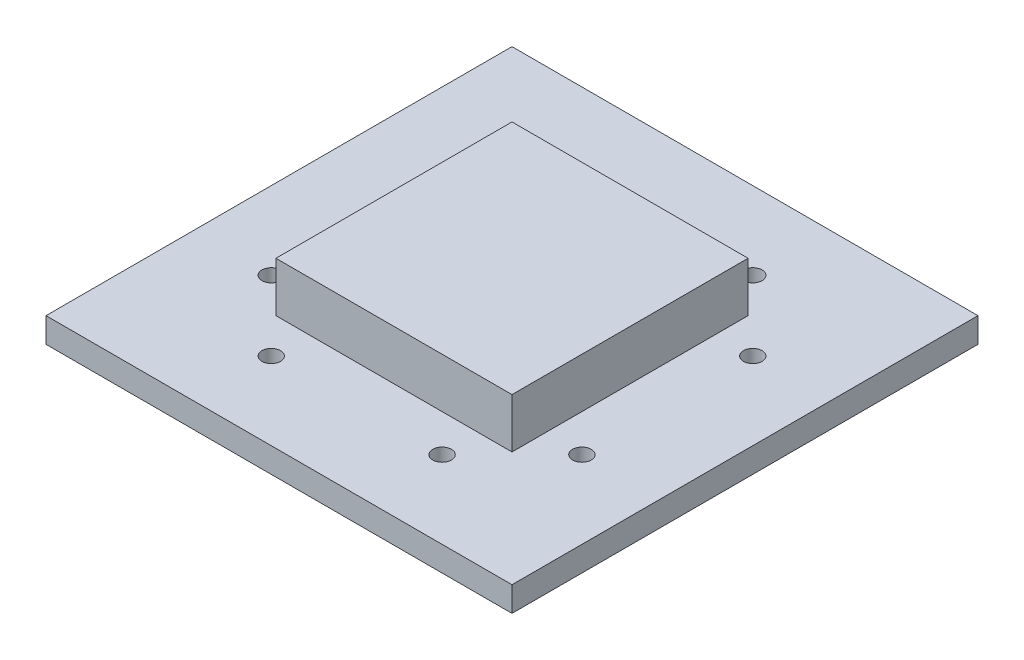
ISO-10303-21;
HEADER;
FILE_DESCRIPTION(('STEP AP214'),'2;1');
FILE_NAME('part.step','',(''),(''),'','','');
FILE_SCHEMA(('AUTOMOTIVE_DESIGN { 1 0 10303 214 1 1 1 1 }'));
ENDSEC;
DATA;
#1=APPLICATION_CONTEXT('core data for automotive mechanical design processes');
#2=APPLICATION_PROTOCOL_DEFINITION('international standard','automotive_design',2000,#1);
#3=PRODUCT_CONTEXT('',#1,'mechanical');
#4=PRODUCT('Part','Part','',(#3));
#5=PRODUCT_RELATED_PRODUCT_CATEGORY('part','',(#4));
#6=PRODUCT_DEFINITION_FORMATION('','',#4);
#7=PRODUCT_DEFINITION_CONTEXT('part definition',#1,'design');
#8=PRODUCT_DEFINITION('design','',#6,#7);
#9=PRODUCT_DEFINITION_SHAPE('','',#8);
#10=(LENGTH_UNIT() NAMED_UNIT(*) SI_UNIT(.MILLI.,.METRE.));
#11=(NAMED_UNIT(*) PLANE_ANGLE_UNIT() SI_UNIT($,.RADIAN.));
#12=(NAMED_UNIT(*) SI_UNIT($,.STERADIAN.) SOLID_ANGLE_UNIT());
#13=UNCERTAINTY_MEASURE_WITH_UNIT(LENGTH_MEASURE(1.E-05),#10,'distance_accuracy_value','');
#14=(GEOMETRIC_REPRESENTATION_CONTEXT(3) GLOBAL_UNCERTAINTY_ASSIGNED_CONTEXT((#13)) GLOBAL_UNIT_ASSIGNED_CONTEXT((#10,
#11,#12)) REPRESENTATION_CONTEXT('',''));
#15=CARTESIAN_POINT('',(0.,0.,0.));
#16=DIRECTION('',(0.,0.,1.));
#17=DIRECTION('',(1.,0.,0.));
#18=AXIS2_PLACEMENT_3D('',#15,#16,#17);
#19=CARTESIAN_POINT('',(0.,1.6,0.));
#20=DIRECTION('',(0.,1.,0.));
#21=DIRECTION('',(0.,0.,1.));
#22=AXIS2_PLACEMENT_3D('',#19,#20,#21);
#23=PLANE('',#22);
#24=CARTESIAN_POINT('',(25.,1.6,-9.50000000000003));
#25=DIRECTION('',(0.,1.,0.));
#26=DIRECTION('',(-1.,0.,0.));
#27=AXIS2_PLACEMENT_3D('',#24,#25,#26);
#28=CIRCLE('',#27,0.6);
#29=CARTESIAN_POINT('',(24.4,1.6,-9.50000000000003));
#30=VERTEX_POINT('',#29);
#31=EDGE_CURVE('E151',#30,#30,#28,.T.);
#32=ORIENTED_EDGE('',*,*,#31,.F.);
#33=EDGE_LOOP('',(#32));
#34=FACE_BOUND('',#33,.T.);
#35=CARTESIAN_POINT('',(4.99999999999998,1.6,-20.5));
#36=DIRECTION('',(0.,1.,0.));
#37=DIRECTION('',(-1.,0.,0.));
#38=AXIS2_PLACEMENT_3D('',#35,#36,#37);
#39=CIRCLE('',#38,0.6);
#40=CARTESIAN_POINT('',(4.39999999999998,1.6,-20.5));
#41=VERTEX_POINT('',#40);
#42=EDGE_CURVE('E145',#41,#41,#39,.T.);
#43=ORIENTED_EDGE('',*,*,#42,.F.);
#44=EDGE_LOOP('',(#43));
#45=FACE_BOUND('',#44,.T.);
#46=CARTESIAN_POINT('',(5.00000000000002,1.6,-9.49999999999996));
#47=DIRECTION('',(0.,1.,0.));
#48=DIRECTION('',(1.,0.,0.));
#49=AXIS2_PLACEMENT_3D('',#46,#47,#48);
#50=CIRCLE('',#49,0.6);
#51=CARTESIAN_POINT('',(5.60000000000001,1.6,-9.49999999999996));
#52=VERTEX_POINT('',#51);
#53=EDGE_CURVE('E136',#52,#52,#50,.T.);
#54=ORIENTED_EDGE('',*,*,#53,.F.);
#55=EDGE_LOOP('',(#54));
#56=FACE_BOUND('',#55,.T.);
#57=CARTESIAN_POINT('',(25.,1.6,-20.5));
#58=DIRECTION('',(0.,1.,0.));
#59=DIRECTION('',(1.,0.,0.));
#60=AXIS2_PLACEMENT_3D('',#57,#58,#59);
#61=CIRCLE('',#60,0.6);
#62=CARTESIAN_POINT('',(25.6,1.6,-20.5));
#63=VERTEX_POINT('',#62);
#64=EDGE_CURVE('E150',#63,#63,#61,.T.);
#65=ORIENTED_EDGE('',*,*,#64,.F.);
#66=EDGE_LOOP('',(#65));
#67=FACE_BOUND('',#66,.T.);
#68=CARTESIAN_POINT('',(9.5,1.6,-5.));
#69=DIRECTION('',(0.,1.,0.));
#70=DIRECTION('',(0.,0.,-1.));
#71=AXIS2_PLACEMENT_3D('',#68,#69,#70);
#72=CIRCLE('',#71,0.6);
#73=CARTESIAN_POINT('',(9.5,1.6,-5.6));
#74=VERTEX_POINT('',#73);
#75=EDGE_CURVE('E175',#74,#74,#72,.T.);
#76=ORIENTED_EDGE('',*,*,#75,.F.);
#77=EDGE_LOOP('',(#76));
#78=FACE_BOUND('',#77,.T.);
#79=CARTESIAN_POINT('',(20.5,1.6,-25.));
#80=DIRECTION('',(0.,1.,0.));
#81=DIRECTION('',(0.,0.,-1.));
#82=AXIS2_PLACEMENT_3D('',#79,#80,#81);
#83=CIRCLE('',#82,0.6);
#84=CARTESIAN_POINT('',(20.5,1.6,-25.6));
#85=VERTEX_POINT('',#84);
#86=EDGE_CURVE('E168',#85,#85,#83,.T.);
#87=ORIENTED_EDGE('',*,*,#86,.F.);
#88=EDGE_LOOP('',(#87));
#89=FACE_BOUND('',#88,.T.);
#90=CARTESIAN_POINT('',(9.5,1.6,-25.));
#91=DIRECTION('',(0.,1.,0.));
#92=DIRECTION('',(0.,0.,1.));
#93=AXIS2_PLACEMENT_3D('',#90,#91,#92);
#94=CIRCLE('',#93,0.6);
#95=CARTESIAN_POINT('',(9.5,1.6,-24.4));
#96=VERTEX_POINT('',#95);
#97=EDGE_CURVE('E162',#96,#96,#94,.T.);
#98=ORIENTED_EDGE('',*,*,#97,.F.);
#99=EDGE_LOOP('',(#98));
#100=FACE_BOUND('',#99,.T.);
#101=CARTESIAN_POINT('',(20.5,1.6,-5.));
#102=DIRECTION('',(0.,1.,0.));
#103=DIRECTION('',(0.,0.,1.));
#104=AXIS2_PLACEMENT_3D('',#101,#102,#103);
#105=CIRCLE('',#104,0.6);
#106=CARTESIAN_POINT('',(20.5,1.6,-4.4));
#107=VERTEX_POINT('',#106);
#108=EDGE_CURVE('E174',#107,#107,#105,.T.);
#109=ORIENTED_EDGE('',*,*,#108,.F.);
#110=EDGE_LOOP('',(#109));
#111=FACE_BOUND('',#110,.T.);
#112=DIRECTION('',(1.,0.,0.));
#113=VECTOR('',#112,1.);
#114=CARTESIAN_POINT('',(0.,1.6,0.));
#115=LINE('',#114,#113);
#116=CARTESIAN_POINT('',(0.,1.6,0.));
#117=VERTEX_POINT('',#116);
#118=CARTESIAN_POINT('',(30.,1.6,0.));
#119=VERTEX_POINT('',#118);
#120=EDGE_CURVE('E189',#117,#119,#115,.T.);
#121=ORIENTED_EDGE('',*,*,#120,.T.);
#122=DIRECTION('',(0.,0.,-1.));
#123=VECTOR('',#122,1.);
#124=CARTESIAN_POINT('',(30.,1.6,0.));
#125=LINE('',#124,#123);
#126=CARTESIAN_POINT('',(30.,1.6,-30.));
#127=VERTEX_POINT('',#126);
#128=EDGE_CURVE('E88',#119,#127,#125,.T.);
#129=ORIENTED_EDGE('',*,*,#128,.T.);
#130=DIRECTION('',(1.,0.,0.));
#131=VECTOR('',#130,1.);
#132=CARTESIAN_POINT('',(0.,1.6,-30.));
#133=LINE('',#132,#131);
#134=CARTESIAN_POINT('',(0.,1.6,-30.));
#135=VERTEX_POINT('',#134);
#136=EDGE_CURVE('E193',#135,#127,#133,.T.);
#137=ORIENTED_EDGE('',*,*,#136,.F.);
#138=DIRECTION('',(0.,0.,-1.));
#139=VECTOR('',#138,1.);
#140=CARTESIAN_POINT('',(0.,1.6,0.));
#141=LINE('',#140,#139);
#142=EDGE_CURVE('E196',#117,#135,#141,.T.);
#143=ORIENTED_EDGE('',*,*,#142,.F.);
#144=EDGE_LOOP('',(#121,#129,#137,#143));
#145=FACE_BOUND('',#144,.T.);
#146=DIRECTION('',(-1.,0.,0.));
#147=VECTOR('',#146,1.);
#148=CARTESIAN_POINT('',(7.4,1.6,-22.6));
#149=LINE('',#148,#147);
#150=CARTESIAN_POINT('',(22.6,1.6,-22.6));
#151=VERTEX_POINT('',#150);
#152=CARTESIAN_POINT('',(7.4,1.6,-22.6));
#153=VERTEX_POINT('',#152);
#154=EDGE_CURVE('E406',#151,#153,#149,.T.);
#155=ORIENTED_EDGE('',*,*,#154,.F.);
#156=DIRECTION('',(0.,0.,-1.));
#157=VECTOR('',#156,1.);
#158=CARTESIAN_POINT('',(22.6,1.6,-22.6));
#159=LINE('',#158,#157);
#160=CARTESIAN_POINT('',(22.6,1.6,-7.4));
#161=VERTEX_POINT('',#160);
#162=EDGE_CURVE('E134',#161,#151,#159,.T.);
#163=ORIENTED_EDGE('',*,*,#162,.F.);
#164=DIRECTION('',(1.,0.,0.));
#165=VECTOR('',#164,1.);
#166=CARTESIAN_POINT('',(7.4,1.6,-7.4));
#167=LINE('',#166,#165);
#168=CARTESIAN_POINT('',(7.4,1.6,-7.4));
#169=VERTEX_POINT('',#168);
#170=EDGE_CURVE('E130',#169,#161,#167,.T.);
#171=ORIENTED_EDGE('',*,*,#170,.F.);
#172=DIRECTION('',(0.,0.,1.));
#173=VECTOR('',#172,1.);
#174=CARTESIAN_POINT('',(7.4,1.6,-22.6));
#175=LINE('',#174,#173);
#176=EDGE_CURVE('E403',#153,#169,#175,.T.);
#177=ORIENTED_EDGE('',*,*,#176,.F.);
#178=EDGE_LOOP('',(#155,#163,#171,#177));
#179=FACE_BOUND('',#178,.T.);
#180=ADVANCED_FACE('F38',(#34,#45,#56,#67,#78,#89,#100,#111,#145,#179),#23,.T.);
#181=CARTESIAN_POINT('',(0.,1.6,0.));
#182=DIRECTION('',(0.,0.,-1.));
#183=DIRECTION('',(-1.,0.,0.));
#184=AXIS2_PLACEMENT_3D('',#181,#182,#183);
#185=PLANE('',#184);
#186=DIRECTION('',(1.,0.,0.));
#187=VECTOR('',#186,1.);
#188=CARTESIAN_POINT('',(0.,0.,0.));
#189=LINE('',#188,#187);
#190=CARTESIAN_POINT('',(0.,0.,0.));
#191=VERTEX_POINT('',#190);
#192=CARTESIAN_POINT('',(30.,0.,0.));
#193=VERTEX_POINT('',#192);
#194=EDGE_CURVE('E186',#191,#193,#189,.T.);
#195=ORIENTED_EDGE('',*,*,#194,.T.);
#196=DIRECTION('',(0.,-1.,0.));
#197=VECTOR('',#196,1.);
#198=CARTESIAN_POINT('',(30.,1.6,0.));
#199=LINE('',#198,#197);
#200=EDGE_CURVE('E11',#119,#193,#199,.T.);
#201=ORIENTED_EDGE('',*,*,#200,.F.);
#202=ORIENTED_EDGE('',*,*,#120,.F.);
#203=DIRECTION('',(0.,-1.,0.));
#204=VECTOR('',#203,1.);
#205=CARTESIAN_POINT('',(0.,1.6,0.));
#206=LINE('',#205,#204);
#207=EDGE_CURVE('E62',#117,#191,#206,.T.);
#208=ORIENTED_EDGE('',*,*,#207,.T.);
#209=EDGE_LOOP('',(#195,#201,#202,#208));
#210=FACE_BOUND('',#209,.T.);
#211=ADVANCED_FACE('F40',(#210),#185,.F.);
#212=CARTESIAN_POINT('',(30.,1.6,0.));
#213=DIRECTION('',(-1.,0.,0.));
#214=DIRECTION('',(0.,0.,1.));
#215=AXIS2_PLACEMENT_3D('',#212,#213,#214);
#216=PLANE('',#215);
#217=DIRECTION('',(0.,0.,-1.));
#218=VECTOR('',#217,1.);
#219=CARTESIAN_POINT('',(30.,0.,0.));
#220=LINE('',#219,#218);
#221=CARTESIAN_POINT('',(30.,0.,-30.));
#222=VERTEX_POINT('',#221);
#223=EDGE_CURVE('E199',#193,#222,#220,.T.);
#224=ORIENTED_EDGE('',*,*,#223,.T.);
#225=DIRECTION('',(0.,-1.,0.));
#226=VECTOR('',#225,1.);
#227=CARTESIAN_POINT('',(30.,1.6,-30.));
#228=LINE('',#227,#226);
#229=EDGE_CURVE('E46',#127,#222,#228,.T.);
#230=ORIENTED_EDGE('',*,*,#229,.F.);
#231=ORIENTED_EDGE('',*,*,#128,.F.);
#232=ORIENTED_EDGE('',*,*,#200,.T.);
#233=EDGE_LOOP('',(#224,#230,#231,#232));
#234=FACE_BOUND('',#233,.T.);
#235=ADVANCED_FACE('F213',(#234),#216,.F.);
#236=CARTESIAN_POINT('',(0.,1.6,-30.));
#237=DIRECTION('',(0.,0.,-1.));
#238=DIRECTION('',(-1.,0.,0.));
#239=AXIS2_PLACEMENT_3D('',#236,#237,#238);
#240=PLANE('',#239);
#241=DIRECTION('',(1.,0.,0.));
#242=VECTOR('',#241,1.);
#243=CARTESIAN_POINT('',(0.,0.,-30.));
#244=LINE('',#243,#242);
#245=CARTESIAN_POINT('',(0.,0.,-30.));
#246=VERTEX_POINT('',#245);
#247=EDGE_CURVE('E202',#246,#222,#244,.T.);
#248=ORIENTED_EDGE('',*,*,#247,.F.);
#249=DIRECTION('',(0.,-1.,0.));
#250=VECTOR('',#249,1.);
#251=CARTESIAN_POINT('',(0.,1.6,-30.));
#252=LINE('',#251,#250);
#253=EDGE_CURVE('E208',#135,#246,#252,.T.);
#254=ORIENTED_EDGE('',*,*,#253,.F.);
#255=ORIENTED_EDGE('',*,*,#136,.T.);
#256=ORIENTED_EDGE('',*,*,#229,.T.);
#257=EDGE_LOOP('',(#248,#254,#255,#256));
#258=FACE_BOUND('',#257,.T.);
#259=ADVANCED_FACE('F211',(#258),#240,.T.);
#260=CARTESIAN_POINT('',(0.,1.6,0.));
#261=DIRECTION('',(-1.,0.,0.));
#262=DIRECTION('',(0.,0.,1.));
#263=AXIS2_PLACEMENT_3D('',#260,#261,#262);
#264=PLANE('',#263);
#265=DIRECTION('',(0.,0.,-1.));
#266=VECTOR('',#265,1.);
#267=CARTESIAN_POINT('',(0.,0.,0.));
#268=LINE('',#267,#266);
#269=EDGE_CURVE('E191',#191,#246,#268,.T.);
#270=ORIENTED_EDGE('',*,*,#269,.F.);
#271=ORIENTED_EDGE('',*,*,#207,.F.);
#272=ORIENTED_EDGE('',*,*,#142,.T.);
#273=ORIENTED_EDGE('',*,*,#253,.T.);
#274=EDGE_LOOP('',(#270,#271,#272,#273));
#275=FACE_BOUND('',#274,.T.);
#276=ADVANCED_FACE('F217',(#275),#264,.T.);
#277=CARTESIAN_POINT('',(0.,0.,0.));
#278=DIRECTION('',(0.,1.,0.));
#279=DIRECTION('',(0.,0.,1.));
#280=AXIS2_PLACEMENT_3D('',#277,#278,#279);
#281=PLANE('',#280);
#282=CARTESIAN_POINT('',(25.,0.,-9.50000000000003));
#283=DIRECTION('',(0.,1.,0.));
#284=DIRECTION('',(-1.,0.,0.));
#285=AXIS2_PLACEMENT_3D('',#282,#283,#284);
#286=CIRCLE('',#285,0.6);
#287=CARTESIAN_POINT('',(24.4,0.,-9.50000000000003));
#288=VERTEX_POINT('',#287);
#289=EDGE_CURVE('E147',#288,#288,#286,.T.);
#290=ORIENTED_EDGE('',*,*,#289,.T.);
#291=EDGE_LOOP('',(#290));
#292=FACE_BOUND('',#291,.T.);
#293=CARTESIAN_POINT('',(4.99999999999998,0.,-20.5));
#294=DIRECTION('',(0.,1.,0.));
#295=DIRECTION('',(-1.,0.,0.));
#296=AXIS2_PLACEMENT_3D('',#293,#294,#295);
#297=CIRCLE('',#296,0.6);
#298=CARTESIAN_POINT('',(4.39999999999998,0.,-20.5));
#299=VERTEX_POINT('',#298);
#300=EDGE_CURVE('E154',#299,#299,#297,.T.);
#301=ORIENTED_EDGE('',*,*,#300,.T.);
#302=EDGE_LOOP('',(#301));
#303=FACE_BOUND('',#302,.T.);
#304=CARTESIAN_POINT('',(5.00000000000002,0.,-9.49999999999996));
#305=DIRECTION('',(0.,1.,0.));
#306=DIRECTION('',(1.,0.,0.));
#307=AXIS2_PLACEMENT_3D('',#304,#305,#306);
#308=CIRCLE('',#307,0.6);
#309=CARTESIAN_POINT('',(5.60000000000001,0.,-9.49999999999996));
#310=VERTEX_POINT('',#309);
#311=EDGE_CURVE('E139',#310,#310,#308,.T.);
#312=ORIENTED_EDGE('',*,*,#311,.T.);
#313=EDGE_LOOP('',(#312));
#314=FACE_BOUND('',#313,.T.);
#315=CARTESIAN_POINT('',(25.,0.,-20.5));
#316=DIRECTION('',(0.,1.,0.));
#317=DIRECTION('',(1.,0.,0.));
#318=AXIS2_PLACEMENT_3D('',#315,#316,#317);
#319=CIRCLE('',#318,0.6);
#320=CARTESIAN_POINT('',(25.6,0.,-20.5));
#321=VERTEX_POINT('',#320);
#322=EDGE_CURVE('E159',#321,#321,#319,.T.);
#323=ORIENTED_EDGE('',*,*,#322,.T.);
#324=EDGE_LOOP('',(#323));
#325=FACE_BOUND('',#324,.T.);
#326=CARTESIAN_POINT('',(9.5,0.,-5.));
#327=DIRECTION('',(0.,1.,0.));
#328=DIRECTION('',(0.,0.,-1.));
#329=AXIS2_PLACEMENT_3D('',#326,#327,#328);
#330=CIRCLE('',#329,0.6);
#331=CARTESIAN_POINT('',(9.5,0.,-5.6));
#332=VERTEX_POINT('',#331);
#333=EDGE_CURVE('E171',#332,#332,#330,.T.);
#334=ORIENTED_EDGE('',*,*,#333,.T.);
#335=EDGE_LOOP('',(#334));
#336=FACE_BOUND('',#335,.T.);
#337=CARTESIAN_POINT('',(20.5,0.,-25.));
#338=DIRECTION('',(0.,1.,0.));
#339=DIRECTION('',(0.,0.,-1.));
#340=AXIS2_PLACEMENT_3D('',#337,#338,#339);
#341=CIRCLE('',#340,0.6);
#342=CARTESIAN_POINT('',(20.5,0.,-25.6));
#343=VERTEX_POINT('',#342);
#344=EDGE_CURVE('E178',#343,#343,#341,.T.);
#345=ORIENTED_EDGE('',*,*,#344,.T.);
#346=EDGE_LOOP('',(#345));
#347=FACE_BOUND('',#346,.T.);
#348=CARTESIAN_POINT('',(9.5,0.,-25.));
#349=DIRECTION('',(0.,1.,0.));
#350=DIRECTION('',(0.,0.,1.));
#351=AXIS2_PLACEMENT_3D('',#348,#349,#350);
#352=CIRCLE('',#351,0.6);
#353=CARTESIAN_POINT('',(9.5,0.,-24.4));
#354=VERTEX_POINT('',#353);
#355=EDGE_CURVE('E165',#354,#354,#352,.T.);
#356=ORIENTED_EDGE('',*,*,#355,.T.);
#357=EDGE_LOOP('',(#356));
#358=FACE_BOUND('',#357,.T.);
#359=CARTESIAN_POINT('',(20.5,0.,-5.));
#360=DIRECTION('',(0.,1.,0.));
#361=DIRECTION('',(0.,0.,1.));
#362=AXIS2_PLACEMENT_3D('',#359,#360,#361);
#363=CIRCLE('',#362,0.6);
#364=CARTESIAN_POINT('',(20.5,0.,-4.4));
#365=VERTEX_POINT('',#364);
#366=EDGE_CURVE('E183',#365,#365,#363,.T.);
#367=ORIENTED_EDGE('',*,*,#366,.T.);
#368=EDGE_LOOP('',(#367));
#369=FACE_BOUND('',#368,.T.);
#370=ORIENTED_EDGE('',*,*,#194,.F.);
#371=ORIENTED_EDGE('',*,*,#269,.T.);
#372=ORIENTED_EDGE('',*,*,#247,.T.);
#373=ORIENTED_EDGE('',*,*,#223,.F.);
#374=EDGE_LOOP('',(#370,#371,#372,#373));
#375=FACE_BOUND('',#374,.T.);
#376=ADVANCED_FACE('F216',(#292,#303,#314,#325,#336,#347,#358,#369,#375),#281,.F.);
#377=CARTESIAN_POINT('',(20.5,0.,-5.));
#378=DIRECTION('',(0.,1.,0.));
#379=DIRECTION('',(0.,0.,1.));
#380=AXIS2_PLACEMENT_3D('',#377,#378,#379);
#381=CYLINDRICAL_SURFACE('',#380,0.6);
#382=ORIENTED_EDGE('',*,*,#366,.F.);
#383=EDGE_LOOP('',(#382));
#384=FACE_BOUND('',#383,.T.);
#385=ORIENTED_EDGE('',*,*,#108,.T.);
#386=EDGE_LOOP('',(#385));
#387=FACE_BOUND('',#386,.T.);
#388=ADVANCED_FACE('F234',(#384,#387),#381,.F.);
#389=CARTESIAN_POINT('',(9.5,0.,-25.));
#390=DIRECTION('',(0.,1.,0.));
#391=DIRECTION('',(0.,0.,1.));
#392=AXIS2_PLACEMENT_3D('',#389,#390,#391);
#393=CYLINDRICAL_SURFACE('',#392,0.6);
#394=ORIENTED_EDGE('',*,*,#355,.F.);
#395=EDGE_LOOP('',(#394));
#396=FACE_BOUND('',#395,.T.);
#397=ORIENTED_EDGE('',*,*,#97,.T.);
#398=EDGE_LOOP('',(#397));
#399=FACE_BOUND('',#398,.T.);
#400=ADVANCED_FACE('F262',(#396,#399),#393,.F.);
#401=CARTESIAN_POINT('',(20.5,0.,-25.));
#402=DIRECTION('',(0.,1.,0.));
#403=DIRECTION('',(0.,0.,1.));
#404=AXIS2_PLACEMENT_3D('',#401,#402,#403);
#405=CYLINDRICAL_SURFACE('',#404,0.6);
#406=ORIENTED_EDGE('',*,*,#344,.F.);
#407=EDGE_LOOP('',(#406));
#408=FACE_BOUND('',#407,.T.);
#409=ORIENTED_EDGE('',*,*,#86,.T.);
#410=EDGE_LOOP('',(#409));
#411=FACE_BOUND('',#410,.T.);
#412=ADVANCED_FACE('F269',(#408,#411),#405,.F.);
#413=CARTESIAN_POINT('',(9.5,0.,-5.));
#414=DIRECTION('',(0.,1.,0.));
#415=DIRECTION('',(0.,0.,1.));
#416=AXIS2_PLACEMENT_3D('',#413,#414,#415);
#417=CYLINDRICAL_SURFACE('',#416,0.6);
#418=ORIENTED_EDGE('',*,*,#333,.F.);
#419=EDGE_LOOP('',(#418));
#420=FACE_BOUND('',#419,.T.);
#421=ORIENTED_EDGE('',*,*,#75,.T.);
#422=EDGE_LOOP('',(#421));
#423=FACE_BOUND('',#422,.T.);
#424=ADVANCED_FACE('F277',(#420,#423),#417,.F.);
#425=CARTESIAN_POINT('',(25.,0.,-20.5));
#426=DIRECTION('',(0.,1.,0.));
#427=DIRECTION('',(0.,0.,1.));
#428=AXIS2_PLACEMENT_3D('',#425,#426,#427);
#429=CYLINDRICAL_SURFACE('',#428,0.6);
#430=ORIENTED_EDGE('',*,*,#322,.F.);
#431=EDGE_LOOP('',(#430));
#432=FACE_BOUND('',#431,.T.);
#433=ORIENTED_EDGE('',*,*,#64,.T.);
#434=EDGE_LOOP('',(#433));
#435=FACE_BOUND('',#434,.T.);
#436=ADVANCED_FACE('F283',(#432,#435),#429,.F.);
#437=CARTESIAN_POINT('',(5.00000000000002,0.,-9.49999999999996));
#438=DIRECTION('',(0.,1.,0.));
#439=DIRECTION('',(0.,0.,1.));
#440=AXIS2_PLACEMENT_3D('',#437,#438,#439);
#441=CYLINDRICAL_SURFACE('',#440,0.6);
#442=ORIENTED_EDGE('',*,*,#311,.F.);
#443=EDGE_LOOP('',(#442));
#444=FACE_BOUND('',#443,.T.);
#445=ORIENTED_EDGE('',*,*,#53,.T.);
#446=EDGE_LOOP('',(#445));
#447=FACE_BOUND('',#446,.T.);
#448=ADVANCED_FACE('F290',(#444,#447),#441,.F.);
#449=CARTESIAN_POINT('',(4.99999999999998,0.,-20.5));
#450=DIRECTION('',(0.,1.,0.));
#451=DIRECTION('',(0.,0.,1.));
#452=AXIS2_PLACEMENT_3D('',#449,#450,#451);
#453=CYLINDRICAL_SURFACE('',#452,0.6);
#454=ORIENTED_EDGE('',*,*,#300,.F.);
#455=EDGE_LOOP('',(#454));
#456=FACE_BOUND('',#455,.T.);
#457=ORIENTED_EDGE('',*,*,#42,.T.);
#458=EDGE_LOOP('',(#457));
#459=FACE_BOUND('',#458,.T.);
#460=ADVANCED_FACE('F298',(#456,#459),#453,.F.);
#461=CARTESIAN_POINT('',(25.,0.,-9.50000000000003));
#462=DIRECTION('',(0.,1.,0.));
#463=DIRECTION('',(0.,0.,1.));
#464=AXIS2_PLACEMENT_3D('',#461,#462,#463);
#465=CYLINDRICAL_SURFACE('',#464,0.6);
#466=ORIENTED_EDGE('',*,*,#289,.F.);
#467=EDGE_LOOP('',(#466));
#468=FACE_BOUND('',#467,.T.);
#469=ORIENTED_EDGE('',*,*,#31,.T.);
#470=EDGE_LOOP('',(#469));
#471=FACE_BOUND('',#470,.T.);
#472=ADVANCED_FACE('F306',(#468,#471),#465,.F.);
#473=CARTESIAN_POINT('',(22.6,4.8,-22.6));
#474=DIRECTION('',(-1.,0.,0.));
#475=DIRECTION('',(0.,0.,1.));
#476=AXIS2_PLACEMENT_3D('',#473,#474,#475);
#477=PLANE('',#476);
#478=ORIENTED_EDGE('',*,*,#162,.T.);
#479=DIRECTION('',(0.,-1.,0.));
#480=VECTOR('',#479,1.);
#481=CARTESIAN_POINT('',(22.6,4.8,-22.6));
#482=LINE('',#481,#480);
#483=CARTESIAN_POINT('',(22.6,4.8,-22.6));
#484=VERTEX_POINT('',#483);
#485=EDGE_CURVE('E115',#484,#151,#482,.T.);
#486=ORIENTED_EDGE('',*,*,#485,.F.);
#487=DIRECTION('',(0.,0.,-1.));
#488=VECTOR('',#487,1.);
#489=CARTESIAN_POINT('',(22.6,4.8,-22.6));
#490=LINE('',#489,#488);
#491=CARTESIAN_POINT('',(22.6,4.8,-7.4));
#492=VERTEX_POINT('',#491);
#493=EDGE_CURVE('E122',#492,#484,#490,.T.);
#494=ORIENTED_EDGE('',*,*,#493,.F.);
#495=DIRECTION('',(0.,-1.,0.));
#496=VECTOR('',#495,1.);
#497=CARTESIAN_POINT('',(22.6,4.8,-7.4));
#498=LINE('',#497,#496);
#499=EDGE_CURVE('E401',#492,#161,#498,.T.);
#500=ORIENTED_EDGE('',*,*,#499,.T.);
#501=EDGE_LOOP('',(#478,#486,#494,#500));
#502=FACE_BOUND('',#501,.T.);
#503=ADVANCED_FACE('F132',(#502),#477,.F.);
#504=CARTESIAN_POINT('',(7.4,4.8,-22.6));
#505=DIRECTION('',(0.,0.,1.));
#506=DIRECTION('',(1.,0.,0.));
#507=AXIS2_PLACEMENT_3D('',#504,#505,#506);
#508=PLANE('',#507);
#509=ORIENTED_EDGE('',*,*,#154,.T.);
#510=DIRECTION('',(0.,-1.,0.));
#511=VECTOR('',#510,1.);
#512=CARTESIAN_POINT('',(7.4,4.8,-22.6));
#513=LINE('',#512,#511);
#514=CARTESIAN_POINT('',(7.4,4.8,-22.6));
#515=VERTEX_POINT('',#514);
#516=EDGE_CURVE('E118',#515,#153,#513,.T.);
#517=ORIENTED_EDGE('',*,*,#516,.F.);
#518=DIRECTION('',(-1.,0.,0.));
#519=VECTOR('',#518,1.);
#520=CARTESIAN_POINT('',(7.4,4.8,-22.6));
#521=LINE('',#520,#519);
#522=EDGE_CURVE('E111',#484,#515,#521,.T.);
#523=ORIENTED_EDGE('',*,*,#522,.F.);
#524=ORIENTED_EDGE('',*,*,#485,.T.);
#525=EDGE_LOOP('',(#509,#517,#523,#524));
#526=FACE_BOUND('',#525,.T.);
#527=ADVANCED_FACE('F113',(#526),#508,.F.);
#528=CARTESIAN_POINT('',(7.4,4.8,-22.6));
#529=DIRECTION('',(1.,0.,0.));
#530=DIRECTION('',(0.,0.,-1.));
#531=AXIS2_PLACEMENT_3D('',#528,#529,#530);
#532=PLANE('',#531);
#533=ORIENTED_EDGE('',*,*,#176,.T.);
#534=DIRECTION('',(0.,-1.,0.));
#535=VECTOR('',#534,1.);
#536=CARTESIAN_POINT('',(7.4,4.8,-7.4));
#537=LINE('',#536,#535);
#538=CARTESIAN_POINT('',(7.4,4.8,-7.4));
#539=VERTEX_POINT('',#538);
#540=EDGE_CURVE('E53',#539,#169,#537,.T.);
#541=ORIENTED_EDGE('',*,*,#540,.F.);
#542=DIRECTION('',(0.,0.,1.));
#543=VECTOR('',#542,1.);
#544=CARTESIAN_POINT('',(7.4,4.8,-22.6));
#545=LINE('',#544,#543);
#546=EDGE_CURVE('E121',#515,#539,#545,.T.);
#547=ORIENTED_EDGE('',*,*,#546,.F.);
#548=ORIENTED_EDGE('',*,*,#516,.T.);
#549=EDGE_LOOP('',(#533,#541,#547,#548));
#550=FACE_BOUND('',#549,.T.);
#551=ADVANCED_FACE('F327',(#550),#532,.F.);
#552=CARTESIAN_POINT('',(7.4,4.8,-7.4));
#553=DIRECTION('',(0.,0.,-1.));
#554=DIRECTION('',(-1.,0.,0.));
#555=AXIS2_PLACEMENT_3D('',#552,#553,#554);
#556=PLANE('',#555);
#557=ORIENTED_EDGE('',*,*,#170,.T.);
#558=ORIENTED_EDGE('',*,*,#499,.F.);
#559=DIRECTION('',(1.,0.,0.));
#560=VECTOR('',#559,1.);
#561=CARTESIAN_POINT('',(7.4,4.8,-7.4));
#562=LINE('',#561,#560);
#563=EDGE_CURVE('E126',#539,#492,#562,.T.);
#564=ORIENTED_EDGE('',*,*,#563,.F.);
#565=ORIENTED_EDGE('',*,*,#540,.T.);
#566=EDGE_LOOP('',(#557,#558,#564,#565));
#567=FACE_BOUND('',#566,.T.);
#568=ADVANCED_FACE('F334',(#567),#556,.F.);
#569=CARTESIAN_POINT('',(0.,4.8,0.));
#570=DIRECTION('',(0.,1.,0.));
#571=DIRECTION('',(0.,0.,1.));
#572=AXIS2_PLACEMENT_3D('',#569,#570,#571);
#573=PLANE('',#572);
#574=ORIENTED_EDGE('',*,*,#493,.T.);
#575=ORIENTED_EDGE('',*,*,#522,.T.);
#576=ORIENTED_EDGE('',*,*,#546,.T.);
#577=ORIENTED_EDGE('',*,*,#563,.T.);
#578=EDGE_LOOP('',(#574,#575,#576,#577));
#579=FACE_BOUND('',#578,.T.);
#580=ADVANCED_FACE('F125',(#579),#573,.T.);
#581=CLOSED_SHELL('',(#180,#211,#235,#259,#276,#376,#388,#400,#412,#424,#436,#448,#460,#472,
#503,#527,#551,#568,#580));
#582=MANIFOLD_SOLID_BREP('B2',#581);
#583=ADVANCED_BREP_SHAPE_REPRESENTATION('',(#18,#582),#14);
#584=SHAPE_DEFINITION_REPRESENTATION(#9,#583);
ENDSEC;
END-ISO-10303-21;
